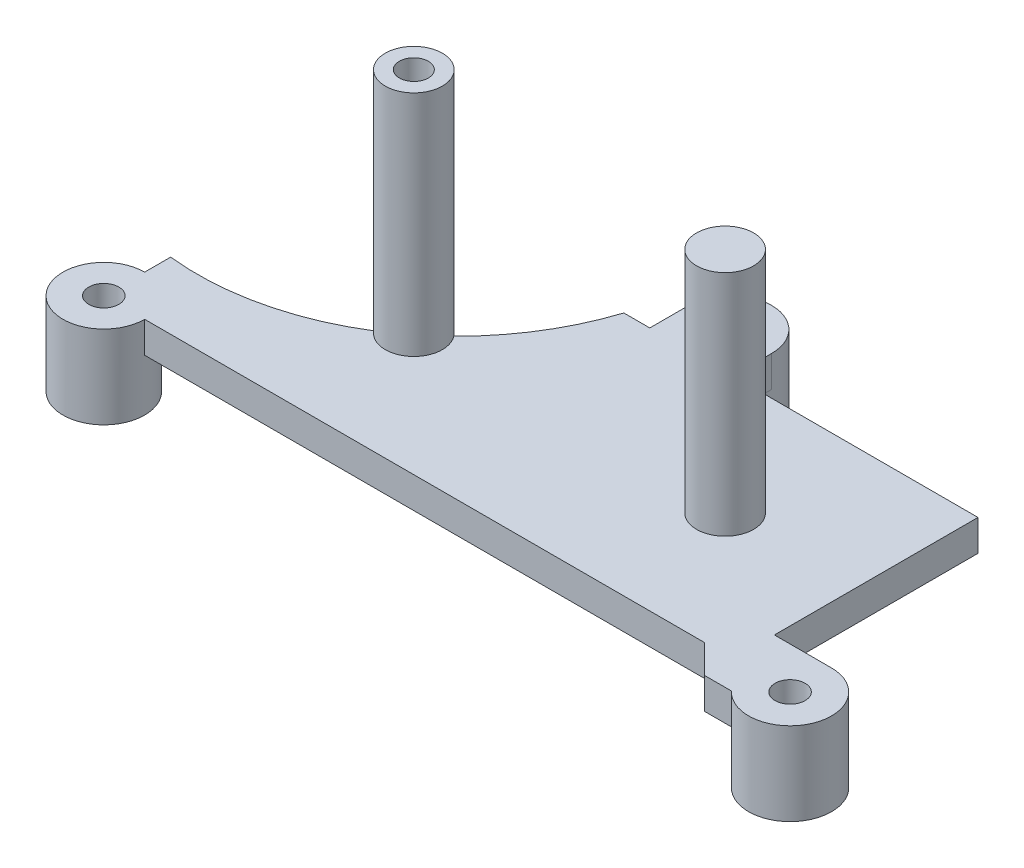
ISO-10303-21;
HEADER;
FILE_DESCRIPTION(('STEP AP214'),'2;1');
FILE_NAME('part.step','',(''),(''),'','','');
FILE_SCHEMA(('AUTOMOTIVE_DESIGN { 1 0 10303 214 1 1 1 1 }'));
ENDSEC;
DATA;
#1=APPLICATION_CONTEXT('core data for automotive mechanical design processes');
#2=APPLICATION_PROTOCOL_DEFINITION('international standard','automotive_design',2000,#1);
#3=PRODUCT_CONTEXT('',#1,'mechanical');
#4=PRODUCT('Part','Part','',(#3));
#5=PRODUCT_RELATED_PRODUCT_CATEGORY('part','',(#4));
#6=PRODUCT_DEFINITION_FORMATION('','',#4);
#7=PRODUCT_DEFINITION_CONTEXT('part definition',#1,'design');
#8=PRODUCT_DEFINITION('design','',#6,#7);
#9=PRODUCT_DEFINITION_SHAPE('','',#8);
#10=(LENGTH_UNIT() NAMED_UNIT(*) SI_UNIT(.MILLI.,.METRE.));
#11=(NAMED_UNIT(*) PLANE_ANGLE_UNIT() SI_UNIT($,.RADIAN.));
#12=(NAMED_UNIT(*) SI_UNIT($,.STERADIAN.) SOLID_ANGLE_UNIT());
#13=UNCERTAINTY_MEASURE_WITH_UNIT(LENGTH_MEASURE(1.E-05),#10,'distance_accuracy_value','');
#14=(GEOMETRIC_REPRESENTATION_CONTEXT(3) GLOBAL_UNCERTAINTY_ASSIGNED_CONTEXT((#13)) GLOBAL_UNIT_ASSIGNED_CONTEXT((#10,
#11,#12)) REPRESENTATION_CONTEXT('',''));
#15=CARTESIAN_POINT('',(0.,0.,0.));
#16=DIRECTION('',(0.,0.,1.));
#17=DIRECTION('',(1.,0.,0.));
#18=AXIS2_PLACEMENT_3D('',#15,#16,#17);
#19=CARTESIAN_POINT('',(0.,0.,0.));
#20=DIRECTION('',(0.,1.,0.));
#21=DIRECTION('',(0.,0.,1.));
#22=AXIS2_PLACEMENT_3D('',#19,#20,#21);
#23=PLANE('',#22);
#24=CARTESIAN_POINT('',(3.40995,0.,-34.7599));
#25=DIRECTION('',(0.,-1.,0.));
#26=DIRECTION('',(0.,0.,-1.));
#27=AXIS2_PLACEMENT_3D('',#24,#25,#26);
#28=CIRCLE('',#27,5.08);
#29=CARTESIAN_POINT('',(8.48995,0.,-34.7599));
#30=VERTEX_POINT('',#29);
#31=CARTESIAN_POINT('',(-1.67005,0.,-34.7599));
#32=VERTEX_POINT('',#31);
#33=EDGE_CURVE('E171',#30,#32,#28,.T.);
#34=ORIENTED_EDGE('',*,*,#33,.F.);
#35=DIRECTION('',(0.,0.,-1.));
#36=VECTOR('',#35,1.);
#37=CARTESIAN_POINT('',(8.48995000000001,0.,0.));
#38=LINE('',#37,#36);
#39=CARTESIAN_POINT('',(8.48995,0.,-29.9974));
#40=VERTEX_POINT('',#39);
#41=EDGE_CURVE('E153',#40,#30,#38,.T.);
#42=ORIENTED_EDGE('',*,*,#41,.F.);
#43=DIRECTION('',(1.,0.,0.));
#44=VECTOR('',#43,1.);
#45=CARTESIAN_POINT('',(0.,0.,-29.9974));
#46=LINE('',#45,#44);
#47=CARTESIAN_POINT('',(38.50005,0.,-29.9974));
#48=VERTEX_POINT('',#47);
#49=EDGE_CURVE('E165',#40,#48,#46,.T.);
#50=ORIENTED_EDGE('',*,*,#49,.T.);
#51=DIRECTION('',(0.,0.,1.));
#52=VECTOR('',#51,1.);
#53=CARTESIAN_POINT('',(38.50005,0.,0.));
#54=LINE('',#53,#52);
#55=CARTESIAN_POINT('',(38.50005,0.,-5.08));
#56=VERTEX_POINT('',#55);
#57=EDGE_CURVE('E318',#48,#56,#54,.T.);
#58=ORIENTED_EDGE('',*,*,#57,.T.);
#59=DIRECTION('',(1.,0.,0.));
#60=VECTOR('',#59,1.);
#61=CARTESIAN_POINT('',(0.,0.,-5.08));
#62=LINE('',#61,#60);
#63=CARTESIAN_POINT('',(45.49775,0.,-5.08));
#64=VERTEX_POINT('',#63);
#65=EDGE_CURVE('E314',#56,#64,#62,.T.);
#66=ORIENTED_EDGE('',*,*,#65,.T.);
#67=CARTESIAN_POINT('',(45.49775,0.,0.));
#68=DIRECTION('',(0.,-1.,0.));
#69=DIRECTION('',(0.,0.,-1.));
#70=AXIS2_PLACEMENT_3D('',#67,#68,#69);
#71=CIRCLE('',#70,5.08);
#72=CARTESIAN_POINT('',(41.8028027406504,0.,3.48622500000001));
#73=VERTEX_POINT('',#72);
#74=EDGE_CURVE('E195',#73,#64,#71,.T.);
#75=ORIENTED_EDGE('',*,*,#74,.F.);
#76=DIRECTION('',(1.,0.,0.));
#77=VECTOR('',#76,1.);
#78=CARTESIAN_POINT('',(0.,0.,3.48622500000001));
#79=LINE('',#78,#77);
#80=CARTESIAN_POINT('',(38.50005,0.,3.48622500000001));
#81=VERTEX_POINT('',#80);
#82=EDGE_CURVE('E310',#81,#73,#79,.T.);
#83=ORIENTED_EDGE('',*,*,#82,.F.);
#84=DIRECTION('',(-0.70710678118655,0.,-0.707106781186545));
#85=VECTOR('',#84,1.);
#86=CARTESIAN_POINT('',(17.5069124999998,0.,-17.5069125));
#87=LINE('',#86,#85);
#88=CARTESIAN_POINT('',(35.013825,0.,0.));
#89=VERTEX_POINT('',#88);
#90=EDGE_CURVE('E306',#81,#89,#87,.T.);
#91=ORIENTED_EDGE('',*,*,#90,.T.);
#92=DIRECTION('',(1.,0.,0.));
#93=VECTOR('',#92,1.);
#94=CARTESIAN_POINT('',(0.,0.,0.));
#95=LINE('',#94,#93);
#96=CARTESIAN_POINT('',(-33.498075,0.,0.));
#97=VERTEX_POINT('',#96);
#98=EDGE_CURVE('E246',#97,#89,#95,.T.);
#99=ORIENTED_EDGE('',*,*,#98,.F.);
#100=CARTESIAN_POINT('',(-38.50005,0.,0.));
#101=DIRECTION('',(0.,-1.,0.));
#102=DIRECTION('',(0.,0.,-1.));
#103=AXIS2_PLACEMENT_3D('',#100,#101,#102);
#104=CIRCLE('',#103,5.00197499999999);
#105=CARTESIAN_POINT('',(-38.50005,0.,-5.00197499999999));
#106=VERTEX_POINT('',#105);
#107=EDGE_CURVE('E206',#106,#97,#104,.T.);
#108=ORIENTED_EDGE('',*,*,#107,.F.);
#109=DIRECTION('',(0.,0.,1.));
#110=VECTOR('',#109,1.);
#111=CARTESIAN_POINT('',(-38.50005,0.,0.));
#112=LINE('',#111,#110);
#113=CARTESIAN_POINT('',(-38.50005,0.,-8.17697499999999));
#114=VERTEX_POINT('',#113);
#115=EDGE_CURVE('E252',#114,#106,#112,.T.);
#116=ORIENTED_EDGE('',*,*,#115,.F.);
#117=CARTESIAN_POINT('',(-35.0631940157804,0.,-39.7404114565035));
#118=DIRECTION('',(0.,1.,0.));
#119=DIRECTION('',(0.,0.,1.));
#120=AXIS2_PLACEMENT_3D('',#117,#118,#119);
#121=CIRCLE('',#120,31.75);
#122=CARTESIAN_POINT('',(-18.2650620731216,0.,-12.7981535103508));
#123=VERTEX_POINT('',#122);
#124=EDGE_CURVE('E237',#114,#123,#121,.T.);
#125=ORIENTED_EDGE('',*,*,#124,.T.);
#126=CARTESIAN_POINT('',(-15.55115,0.,-14.9963886));
#127=DIRECTION('',(0.,1.,0.));
#128=DIRECTION('',(0.,0.,1.));
#129=AXIS2_PLACEMENT_3D('',#126,#127,#128);
#130=CIRCLE('',#129,3.4925);
#131=CARTESIAN_POINT('',(-12.7806774825708,0.,-17.12289707169));
#132=VERTEX_POINT('',#131);
#133=EDGE_CURVE('E56',#132,#123,#130,.T.);
#134=ORIENTED_EDGE('',*,*,#133,.F.);
#135=CARTESIAN_POINT('',(-4.84505,0.,-29.9974));
#136=VERTEX_POINT('',#135);
#137=EDGE_CURVE('E61',#132,#136,#121,.T.);
#138=ORIENTED_EDGE('',*,*,#137,.T.);
#139=CARTESIAN_POINT('',(-1.67005,0.,-29.9974));
#140=VERTEX_POINT('',#139);
#141=EDGE_CURVE('E323',#136,#140,#46,.T.);
#142=ORIENTED_EDGE('',*,*,#141,.T.);
#143=DIRECTION('',(0.,0.,-1.));
#144=VECTOR('',#143,1.);
#145=CARTESIAN_POINT('',(-1.67005,0.,0.));
#146=LINE('',#145,#144);
#147=EDGE_CURVE('E164',#140,#32,#146,.T.);
#148=ORIENTED_EDGE('',*,*,#147,.T.);
#149=EDGE_LOOP('',(#34,#42,#50,#58,#66,#75,#83,#91,#99,#108,#116,#125,#134,#138,#142,#148));
#150=FACE_BOUND('',#149,.T.);
#151=ADVANCED_FACE('F40',(#150),#23,.F.);
#152=CARTESIAN_POINT('',(-35.0631940157804,3.81,-39.7404114565035));
#153=DIRECTION('',(0.,-1.,0.));
#154=DIRECTION('',(0.,0.,-1.));
#155=AXIS2_PLACEMENT_3D('',#152,#153,#154);
#156=CYLINDRICAL_SURFACE('',#155,31.75);
#157=CARTESIAN_POINT('',(-35.0631940157804,3.81,-39.7404114565035));
#158=DIRECTION('',(0.,1.,0.));
#159=DIRECTION('',(0.,0.,1.));
#160=AXIS2_PLACEMENT_3D('',#157,#158,#159);
#161=CIRCLE('',#160,31.75);
#162=CARTESIAN_POINT('',(-38.50005,3.81,-8.17697499999999));
#163=VERTEX_POINT('',#162);
#164=CARTESIAN_POINT('',(-18.2650620731215,3.81,-12.7981535103508));
#165=VERTEX_POINT('',#164);
#166=EDGE_CURVE('E231',#163,#165,#161,.T.);
#167=ORIENTED_EDGE('',*,*,#166,.T.);
#168=DIRECTION('',(0.,-1.,0.));
#169=VECTOR('',#168,1.);
#170=CARTESIAN_POINT('',(-18.2650620731216,15.875,-12.7981535103508));
#171=LINE('',#170,#169);
#172=EDGE_CURVE('E11',#165,#123,#171,.T.);
#173=ORIENTED_EDGE('',*,*,#172,.T.);
#174=ORIENTED_EDGE('',*,*,#124,.F.);
#175=DIRECTION('',(0.,-1.,0.));
#176=VECTOR('',#175,1.);
#177=CARTESIAN_POINT('',(-38.50005,3.81,-8.17697499999999));
#178=LINE('',#177,#176);
#179=EDGE_CURVE('E242',#163,#114,#178,.T.);
#180=ORIENTED_EDGE('',*,*,#179,.F.);
#181=EDGE_LOOP('',(#167,#173,#174,#180));
#182=FACE_BOUND('',#181,.T.);
#183=ADVANCED_FACE('F426',(#182),#156,.F.);
#184=ORIENTED_EDGE('',*,*,#137,.F.);
#185=DIRECTION('',(0.,-1.,0.));
#186=VECTOR('',#185,1.);
#187=CARTESIAN_POINT('',(-12.7806774825708,15.875,-17.12289707169));
#188=LINE('',#187,#186);
#189=CARTESIAN_POINT('',(-12.7806774825708,3.81,-17.12289707169));
#190=VERTEX_POINT('',#189);
#191=EDGE_CURVE('E49',#132,#190,#188,.F.);
#192=ORIENTED_EDGE('',*,*,#191,.T.);
#193=CARTESIAN_POINT('',(-4.84505,3.81,-29.9974));
#194=VERTEX_POINT('',#193);
#195=EDGE_CURVE('E236',#190,#194,#161,.T.);
#196=ORIENTED_EDGE('',*,*,#195,.T.);
#197=DIRECTION('',(0.,-1.,0.));
#198=VECTOR('',#197,1.);
#199=CARTESIAN_POINT('',(-4.84505,3.81,-29.9974));
#200=LINE('',#199,#198);
#201=EDGE_CURVE('E235',#194,#136,#200,.T.);
#202=ORIENTED_EDGE('',*,*,#201,.T.);
#203=EDGE_LOOP('',(#184,#192,#196,#202));
#204=FACE_BOUND('',#203,.T.);
#205=ADVANCED_FACE('F368',(#204),#156,.F.);
#206=CARTESIAN_POINT('',(0.,3.81,-29.9974));
#207=DIRECTION('',(0.,0.,-1.));
#208=DIRECTION('',(-1.,0.,0.));
#209=AXIS2_PLACEMENT_3D('',#206,#207,#208);
#210=PLANE('',#209);
#211=ORIENTED_EDGE('',*,*,#141,.F.);
#212=ORIENTED_EDGE('',*,*,#201,.F.);
#213=DIRECTION('',(1.,0.,0.));
#214=VECTOR('',#213,1.);
#215=CARTESIAN_POINT('',(0.,3.81,-29.9974));
#216=LINE('',#215,#214);
#217=CARTESIAN_POINT('',(-1.67005,3.81,-29.9974));
#218=VERTEX_POINT('',#217);
#219=EDGE_CURVE('E282',#194,#218,#216,.T.);
#220=ORIENTED_EDGE('',*,*,#219,.T.);
#221=DIRECTION('',(0.,-1.,0.));
#222=VECTOR('',#221,1.);
#223=CARTESIAN_POINT('',(-1.67005,3.81,-29.9974));
#224=LINE('',#223,#222);
#225=EDGE_CURVE('E333',#218,#140,#224,.T.);
#226=ORIENTED_EDGE('',*,*,#225,.T.);
#227=EDGE_LOOP('',(#211,#212,#220,#226));
#228=FACE_BOUND('',#227,.T.);
#229=ADVANCED_FACE('F383',(#228),#210,.T.);
#230=CARTESIAN_POINT('',(-38.50005,3.81,0.));
#231=DIRECTION('',(1.,0.,0.));
#232=DIRECTION('',(0.,0.,-1.));
#233=AXIS2_PLACEMENT_3D('',#230,#231,#232);
#234=PLANE('',#233);
#235=ORIENTED_EDGE('',*,*,#179,.T.);
#236=ORIENTED_EDGE('',*,*,#115,.T.);
#237=DIRECTION('',(0.,-1.,0.));
#238=VECTOR('',#237,1.);
#239=CARTESIAN_POINT('',(-38.50005,3.81,-5.00197499999999));
#240=LINE('',#239,#238);
#241=CARTESIAN_POINT('',(-38.50005,3.81,-5.00197499999999));
#242=VERTEX_POINT('',#241);
#243=EDGE_CURVE('E302',#242,#106,#240,.T.);
#244=ORIENTED_EDGE('',*,*,#243,.F.);
#245=DIRECTION('',(0.,0.,1.));
#246=VECTOR('',#245,1.);
#247=CARTESIAN_POINT('',(-38.50005,3.81,0.));
#248=LINE('',#247,#246);
#249=EDGE_CURVE('E291',#163,#242,#248,.T.);
#250=ORIENTED_EDGE('',*,*,#249,.F.);
#251=EDGE_LOOP('',(#235,#236,#244,#250));
#252=FACE_BOUND('',#251,.T.);
#253=ADVANCED_FACE('F424',(#252),#234,.F.);
#254=CARTESIAN_POINT('',(0.,3.81,0.));
#255=DIRECTION('',(0.,1.,0.));
#256=DIRECTION('',(0.,0.,1.));
#257=AXIS2_PLACEMENT_3D('',#254,#255,#256);
#258=PLANE('',#257);
#259=CARTESIAN_POINT('',(22.54885,3.81,-14.9963886));
#260=DIRECTION('',(0.,1.,0.));
#261=DIRECTION('',(0.,0.,1.));
#262=AXIS2_PLACEMENT_3D('',#259,#260,#261);
#263=CIRCLE('',#262,3.4925);
#264=CARTESIAN_POINT('',(22.54885,3.81,-11.5038886));
#265=VERTEX_POINT('',#264);
#266=EDGE_CURVE('E217',#265,#265,#263,.F.);
#267=ORIENTED_EDGE('',*,*,#266,.T.);
#268=EDGE_LOOP('',(#267));
#269=FACE_BOUND('',#268,.T.);
#270=CARTESIAN_POINT('',(45.49775,3.81,0.));
#271=DIRECTION('',(0.,1.,0.));
#272=DIRECTION('',(0.,0.,1.));
#273=AXIS2_PLACEMENT_3D('',#270,#271,#272);
#274=CIRCLE('',#273,1.8415);
#275=CARTESIAN_POINT('',(45.49775,3.81,1.8415));
#276=VERTEX_POINT('',#275);
#277=EDGE_CURVE('E247',#276,#276,#274,.T.);
#278=ORIENTED_EDGE('',*,*,#277,.F.);
#279=EDGE_LOOP('',(#278));
#280=FACE_BOUND('',#279,.T.);
#281=CARTESIAN_POINT('',(-38.50005,3.81,0.));
#282=DIRECTION('',(0.,1.,0.));
#283=DIRECTION('',(0.,0.,1.));
#284=AXIS2_PLACEMENT_3D('',#281,#282,#283);
#285=CIRCLE('',#284,1.8415);
#286=CARTESIAN_POINT('',(-38.50005,3.81,1.8415));
#287=VERTEX_POINT('',#286);
#288=EDGE_CURVE('E294',#287,#287,#285,.T.);
#289=ORIENTED_EDGE('',*,*,#288,.F.);
#290=EDGE_LOOP('',(#289));
#291=FACE_BOUND('',#290,.T.);
#292=CARTESIAN_POINT('',(3.40995,3.81,-34.7599));
#293=DIRECTION('',(0.,1.,0.));
#294=DIRECTION('',(0.,0.,1.));
#295=AXIS2_PLACEMENT_3D('',#292,#293,#294);
#296=CIRCLE('',#295,1.8415);
#297=CARTESIAN_POINT('',(3.40995,3.81,-32.9184));
#298=VERTEX_POINT('',#297);
#299=EDGE_CURVE('E298',#298,#298,#296,.T.);
#300=ORIENTED_EDGE('',*,*,#299,.F.);
#301=EDGE_LOOP('',(#300));
#302=FACE_BOUND('',#301,.T.);
#303=ORIENTED_EDGE('',*,*,#195,.F.);
#304=CARTESIAN_POINT('',(-15.55115,3.81,-14.9963886));
#305=DIRECTION('',(0.,1.,0.));
#306=DIRECTION('',(0.,0.,1.));
#307=AXIS2_PLACEMENT_3D('',#304,#305,#306);
#308=CIRCLE('',#307,3.4925);
#309=EDGE_CURVE('E225',#190,#165,#308,.F.);
#310=ORIENTED_EDGE('',*,*,#309,.T.);
#311=ORIENTED_EDGE('',*,*,#166,.F.);
#312=ORIENTED_EDGE('',*,*,#249,.T.);
#313=CARTESIAN_POINT('',(-38.50005,3.81,0.));
#314=DIRECTION('',(0.,1.,0.));
#315=DIRECTION('',(0.,0.,1.));
#316=AXIS2_PLACEMENT_3D('',#313,#314,#315);
#317=CIRCLE('',#316,5.00197499999999);
#318=CARTESIAN_POINT('',(-33.498075,3.81,0.));
#319=VERTEX_POINT('',#318);
#320=EDGE_CURVE('E251',#242,#319,#317,.T.);
#321=ORIENTED_EDGE('',*,*,#320,.T.);
#322=DIRECTION('',(1.,0.,0.));
#323=VECTOR('',#322,1.);
#324=CARTESIAN_POINT('',(0.,3.81,0.));
#325=LINE('',#324,#323);
#326=CARTESIAN_POINT('',(35.013825,3.81,0.));
#327=VERTEX_POINT('',#326);
#328=EDGE_CURVE('E256',#319,#327,#325,.T.);
#329=ORIENTED_EDGE('',*,*,#328,.T.);
#330=DIRECTION('',(-0.70710678118655,0.,-0.707106781186545));
#331=VECTOR('',#330,1.);
#332=CARTESIAN_POINT('',(17.5069124999998,3.81,-17.5069125));
#333=LINE('',#332,#331);
#334=CARTESIAN_POINT('',(38.50005,3.81,3.48622500000001));
#335=VERTEX_POINT('',#334);
#336=EDGE_CURVE('E259',#335,#327,#333,.T.);
#337=ORIENTED_EDGE('',*,*,#336,.F.);
#338=DIRECTION('',(1.,0.,0.));
#339=VECTOR('',#338,1.);
#340=CARTESIAN_POINT('',(0.,3.81,3.48622500000001));
#341=LINE('',#340,#339);
#342=CARTESIAN_POINT('',(41.8028027406504,3.81,3.48622500000001));
#343=VERTEX_POINT('',#342);
#344=EDGE_CURVE('E263',#335,#343,#341,.T.);
#345=ORIENTED_EDGE('',*,*,#344,.T.);
#346=CARTESIAN_POINT('',(45.49775,3.81,0.));
#347=DIRECTION('',(0.,1.,0.));
#348=DIRECTION('',(0.,0.,1.));
#349=AXIS2_PLACEMENT_3D('',#346,#347,#348);
#350=CIRCLE('',#349,5.08);
#351=CARTESIAN_POINT('',(45.49775,3.81,-5.08));
#352=VERTEX_POINT('',#351);
#353=EDGE_CURVE('E266',#343,#352,#350,.T.);
#354=ORIENTED_EDGE('',*,*,#353,.T.);
#355=DIRECTION('',(1.,0.,0.));
#356=VECTOR('',#355,1.);
#357=CARTESIAN_POINT('',(0.,3.81,-5.08));
#358=LINE('',#357,#356);
#359=CARTESIAN_POINT('',(38.50005,3.81,-5.08));
#360=VERTEX_POINT('',#359);
#361=EDGE_CURVE('E269',#360,#352,#358,.T.);
#362=ORIENTED_EDGE('',*,*,#361,.F.);
#363=DIRECTION('',(0.,0.,1.));
#364=VECTOR('',#363,1.);
#365=CARTESIAN_POINT('',(38.50005,3.81,0.));
#366=LINE('',#365,#364);
#367=CARTESIAN_POINT('',(38.50005,3.81,-29.9974));
#368=VERTEX_POINT('',#367);
#369=EDGE_CURVE('E273',#368,#360,#366,.T.);
#370=ORIENTED_EDGE('',*,*,#369,.F.);
#371=CARTESIAN_POINT('',(8.48995,3.81,-29.9974));
#372=VERTEX_POINT('',#371);
#373=EDGE_CURVE('E277',#372,#368,#216,.T.);
#374=ORIENTED_EDGE('',*,*,#373,.F.);
#375=DIRECTION('',(0.,0.,-1.));
#376=VECTOR('',#375,1.);
#377=CARTESIAN_POINT('',(8.48995000000001,3.81,0.));
#378=LINE('',#377,#376);
#379=CARTESIAN_POINT('',(8.48995,3.81,-34.7599));
#380=VERTEX_POINT('',#379);
#381=EDGE_CURVE('E281',#372,#380,#378,.T.);
#382=ORIENTED_EDGE('',*,*,#381,.T.);
#383=CARTESIAN_POINT('',(3.40995,3.81,-34.7599));
#384=DIRECTION('',(0.,1.,0.));
#385=DIRECTION('',(0.,0.,1.));
#386=AXIS2_PLACEMENT_3D('',#383,#384,#385);
#387=CIRCLE('',#386,5.08);
#388=CARTESIAN_POINT('',(-1.67005,3.81,-34.7599));
#389=VERTEX_POINT('',#388);
#390=EDGE_CURVE('E173',#389,#380,#387,.F.);
#391=ORIENTED_EDGE('',*,*,#390,.F.);
#392=DIRECTION('',(0.,0.,-1.));
#393=VECTOR('',#392,1.);
#394=CARTESIAN_POINT('',(-1.67005,3.81,0.));
#395=LINE('',#394,#393);
#396=EDGE_CURVE('E287',#218,#389,#395,.T.);
#397=ORIENTED_EDGE('',*,*,#396,.F.);
#398=ORIENTED_EDGE('',*,*,#219,.F.);
#399=EDGE_LOOP('',(#303,#310,#311,#312,#321,#329,#337,#345,#354,#362,#370,#374,#382,#391,#397,#398));
#400=FACE_BOUND('',#399,.T.);
#401=ADVANCED_FACE('F373',(#269,#280,#291,#302,#400),#258,.T.);
#402=CARTESIAN_POINT('',(-38.50005,3.81,0.));
#403=DIRECTION('',(0.,-1.,0.));
#404=DIRECTION('',(0.,0.,-1.));
#405=AXIS2_PLACEMENT_3D('',#402,#403,#404);
#406=CYLINDRICAL_SURFACE('',#405,5.00197499999999);
#407=ORIENTED_EDGE('',*,*,#243,.T.);
#408=ORIENTED_EDGE('',*,*,#107,.T.);
#409=DIRECTION('',(0.,-1.,0.));
#410=VECTOR('',#409,1.);
#411=CARTESIAN_POINT('',(-33.498075,3.81,0.));
#412=LINE('',#411,#410);
#413=EDGE_CURVE('E361',#319,#97,#412,.T.);
#414=ORIENTED_EDGE('',*,*,#413,.F.);
#415=ORIENTED_EDGE('',*,*,#320,.F.);
#416=EDGE_LOOP('',(#407,#408,#414,#415));
#417=FACE_BOUND('',#416,.T.);
#418=CARTESIAN_POINT('',(-38.50005,-6.35,0.));
#419=DIRECTION('',(0.,-1.,0.));
#420=DIRECTION('',(0.,0.,-1.));
#421=AXIS2_PLACEMENT_3D('',#418,#419,#420);
#422=CIRCLE('',#421,5.00197499999999);
#423=CARTESIAN_POINT('',(-38.50005,-6.35,-5.00197499999999));
#424=VERTEX_POINT('',#423);
#425=EDGE_CURVE('E207',#424,#424,#422,.T.);
#426=ORIENTED_EDGE('',*,*,#425,.F.);
#427=EDGE_LOOP('',(#426));
#428=FACE_BOUND('',#427,.T.);
#429=ADVANCED_FACE('F419',(#417,#428),#406,.T.);
#430=CARTESIAN_POINT('',(0.,3.81,0.));
#431=DIRECTION('',(0.,0.,-1.));
#432=DIRECTION('',(-1.,0.,0.));
#433=AXIS2_PLACEMENT_3D('',#430,#431,#432);
#434=PLANE('',#433);
#435=ORIENTED_EDGE('',*,*,#98,.T.);
#436=DIRECTION('',(0.,-1.,0.));
#437=VECTOR('',#436,1.);
#438=CARTESIAN_POINT('',(35.013825,3.81,0.));
#439=LINE('',#438,#437);
#440=EDGE_CURVE('E358',#327,#89,#439,.T.);
#441=ORIENTED_EDGE('',*,*,#440,.F.);
#442=ORIENTED_EDGE('',*,*,#328,.F.);
#443=ORIENTED_EDGE('',*,*,#413,.T.);
#444=EDGE_LOOP('',(#435,#441,#442,#443));
#445=FACE_BOUND('',#444,.T.);
#446=ADVANCED_FACE('F416',(#445),#434,.F.);
#447=CARTESIAN_POINT('',(17.5069124999998,3.81,-17.5069125));
#448=DIRECTION('',(-0.707106781186545,0.,0.70710678118655));
#449=DIRECTION('',(0.70710678118655,0.,0.707106781186545));
#450=AXIS2_PLACEMENT_3D('',#447,#448,#449);
#451=PLANE('',#450);
#452=ORIENTED_EDGE('',*,*,#90,.F.);
#453=DIRECTION('',(0.,-1.,0.));
#454=VECTOR('',#453,1.);
#455=CARTESIAN_POINT('',(38.50005,3.81,3.48622500000001));
#456=LINE('',#455,#454);
#457=EDGE_CURVE('E355',#335,#81,#456,.T.);
#458=ORIENTED_EDGE('',*,*,#457,.F.);
#459=ORIENTED_EDGE('',*,*,#336,.T.);
#460=ORIENTED_EDGE('',*,*,#440,.T.);
#461=EDGE_LOOP('',(#452,#458,#459,#460));
#462=FACE_BOUND('',#461,.T.);
#463=ADVANCED_FACE('F410',(#462),#451,.T.);
#464=CARTESIAN_POINT('',(0.,3.81,3.48622500000001));
#465=DIRECTION('',(0.,0.,-1.));
#466=DIRECTION('',(-1.,0.,0.));
#467=AXIS2_PLACEMENT_3D('',#464,#465,#466);
#468=PLANE('',#467);
#469=ORIENTED_EDGE('',*,*,#82,.T.);
#470=DIRECTION('',(0.,-1.,0.));
#471=VECTOR('',#470,1.);
#472=CARTESIAN_POINT('',(41.8028027406504,3.81,3.48622500000001));
#473=LINE('',#472,#471);
#474=EDGE_CURVE('E351',#343,#73,#473,.T.);
#475=ORIENTED_EDGE('',*,*,#474,.F.);
#476=ORIENTED_EDGE('',*,*,#344,.F.);
#477=ORIENTED_EDGE('',*,*,#457,.T.);
#478=EDGE_LOOP('',(#469,#475,#476,#477));
#479=FACE_BOUND('',#478,.T.);
#480=ADVANCED_FACE('F406',(#479),#468,.F.);
#481=CARTESIAN_POINT('',(45.49775,3.81,0.));
#482=DIRECTION('',(0.,-1.,0.));
#483=DIRECTION('',(0.,0.,-1.));
#484=AXIS2_PLACEMENT_3D('',#481,#482,#483);
#485=CYLINDRICAL_SURFACE('',#484,5.08);
#486=ORIENTED_EDGE('',*,*,#474,.T.);
#487=ORIENTED_EDGE('',*,*,#74,.T.);
#488=DIRECTION('',(0.,-1.,0.));
#489=VECTOR('',#488,1.);
#490=CARTESIAN_POINT('',(45.49775,3.81,-5.08));
#491=LINE('',#490,#489);
#492=EDGE_CURVE('E347',#352,#64,#491,.T.);
#493=ORIENTED_EDGE('',*,*,#492,.F.);
#494=ORIENTED_EDGE('',*,*,#353,.F.);
#495=EDGE_LOOP('',(#486,#487,#493,#494));
#496=FACE_BOUND('',#495,.T.);
#497=CARTESIAN_POINT('',(45.49775,-6.35,0.));
#498=DIRECTION('',(0.,-1.,0.));
#499=DIRECTION('',(0.,0.,-1.));
#500=AXIS2_PLACEMENT_3D('',#497,#498,#499);
#501=CIRCLE('',#500,5.08);
#502=CARTESIAN_POINT('',(45.49775,-6.35,-5.08));
#503=VERTEX_POINT('',#502);
#504=EDGE_CURVE('E196',#503,#503,#501,.T.);
#505=ORIENTED_EDGE('',*,*,#504,.F.);
#506=EDGE_LOOP('',(#505));
#507=FACE_BOUND('',#506,.T.);
#508=ADVANCED_FACE('F400',(#496,#507),#485,.T.);
#509=CARTESIAN_POINT('',(0.,3.81,-5.08));
#510=DIRECTION('',(0.,0.,-1.));
#511=DIRECTION('',(-1.,0.,0.));
#512=AXIS2_PLACEMENT_3D('',#509,#510,#511);
#513=PLANE('',#512);
#514=ORIENTED_EDGE('',*,*,#65,.F.);
#515=DIRECTION('',(0.,-1.,0.));
#516=VECTOR('',#515,1.);
#517=CARTESIAN_POINT('',(38.50005,3.81,-5.08));
#518=LINE('',#517,#516);
#519=EDGE_CURVE('E344',#360,#56,#518,.T.);
#520=ORIENTED_EDGE('',*,*,#519,.F.);
#521=ORIENTED_EDGE('',*,*,#361,.T.);
#522=ORIENTED_EDGE('',*,*,#492,.T.);
#523=EDGE_LOOP('',(#514,#520,#521,#522));
#524=FACE_BOUND('',#523,.T.);
#525=ADVANCED_FACE('F396',(#524),#513,.T.);
#526=CARTESIAN_POINT('',(38.50005,3.81,0.));
#527=DIRECTION('',(1.,0.,0.));
#528=DIRECTION('',(0.,0.,-1.));
#529=AXIS2_PLACEMENT_3D('',#526,#527,#528);
#530=PLANE('',#529);
#531=ORIENTED_EDGE('',*,*,#57,.F.);
#532=DIRECTION('',(0.,-1.,0.));
#533=VECTOR('',#532,1.);
#534=CARTESIAN_POINT('',(38.50005,3.81,-29.9974));
#535=LINE('',#534,#533);
#536=EDGE_CURVE('E341',#368,#48,#535,.T.);
#537=ORIENTED_EDGE('',*,*,#536,.F.);
#538=ORIENTED_EDGE('',*,*,#369,.T.);
#539=ORIENTED_EDGE('',*,*,#519,.T.);
#540=EDGE_LOOP('',(#531,#537,#538,#539));
#541=FACE_BOUND('',#540,.T.);
#542=ADVANCED_FACE('F394',(#541),#530,.T.);
#543=ORIENTED_EDGE('',*,*,#49,.F.);
#544=DIRECTION('',(0.,-1.,0.));
#545=VECTOR('',#544,1.);
#546=CARTESIAN_POINT('',(8.48995,3.81,-29.9974));
#547=LINE('',#546,#545);
#548=EDGE_CURVE('E159',#372,#40,#547,.T.);
#549=ORIENTED_EDGE('',*,*,#548,.F.);
#550=ORIENTED_EDGE('',*,*,#373,.T.);
#551=ORIENTED_EDGE('',*,*,#536,.T.);
#552=EDGE_LOOP('',(#543,#549,#550,#551));
#553=FACE_BOUND('',#552,.T.);
#554=ADVANCED_FACE('F390',(#553),#210,.T.);
#555=CARTESIAN_POINT('',(8.48995000000001,3.81,0.));
#556=DIRECTION('',(-1.,0.,0.));
#557=DIRECTION('',(0.,0.,1.));
#558=AXIS2_PLACEMENT_3D('',#555,#556,#557);
#559=PLANE('',#558);
#560=ORIENTED_EDGE('',*,*,#41,.T.);
#561=DIRECTION('',(0.,-1.,0.));
#562=VECTOR('',#561,1.);
#563=CARTESIAN_POINT('',(8.48995,3.81,-34.7599));
#564=LINE('',#563,#562);
#565=EDGE_CURVE('E157',#380,#30,#564,.T.);
#566=ORIENTED_EDGE('',*,*,#565,.F.);
#567=ORIENTED_EDGE('',*,*,#381,.F.);
#568=ORIENTED_EDGE('',*,*,#548,.T.);
#569=EDGE_LOOP('',(#560,#566,#567,#568));
#570=FACE_BOUND('',#569,.T.);
#571=ADVANCED_FACE('F155',(#570),#559,.F.);
#572=CARTESIAN_POINT('',(3.40995,3.81,-34.7599));
#573=DIRECTION('',(0.,-1.,0.));
#574=DIRECTION('',(0.,0.,-1.));
#575=AXIS2_PLACEMENT_3D('',#572,#573,#574);
#576=CYLINDRICAL_SURFACE('',#575,5.08);
#577=ORIENTED_EDGE('',*,*,#565,.T.);
#578=ORIENTED_EDGE('',*,*,#33,.T.);
#579=DIRECTION('',(0.,-1.,0.));
#580=VECTOR('',#579,1.);
#581=CARTESIAN_POINT('',(-1.67005,3.81,-34.7599));
#582=LINE('',#581,#580);
#583=EDGE_CURVE('E175',#389,#32,#582,.T.);
#584=ORIENTED_EDGE('',*,*,#583,.F.);
#585=ORIENTED_EDGE('',*,*,#390,.T.);
#586=EDGE_LOOP('',(#577,#578,#584,#585));
#587=FACE_BOUND('',#586,.T.);
#588=CARTESIAN_POINT('',(3.40995,-6.35,-34.7599));
#589=DIRECTION('',(0.,-1.,0.));
#590=DIRECTION('',(0.,0.,-1.));
#591=AXIS2_PLACEMENT_3D('',#588,#589,#590);
#592=CIRCLE('',#591,5.08);
#593=CARTESIAN_POINT('',(3.40995,-6.35,-39.8399));
#594=VERTEX_POINT('',#593);
#595=EDGE_CURVE('E180',#594,#594,#592,.T.);
#596=ORIENTED_EDGE('',*,*,#595,.F.);
#597=EDGE_LOOP('',(#596));
#598=FACE_BOUND('',#597,.T.);
#599=ADVANCED_FACE('F169',(#587,#598),#576,.T.);
#600=CARTESIAN_POINT('',(-1.67005,3.81,0.));
#601=DIRECTION('',(-1.,0.,0.));
#602=DIRECTION('',(0.,0.,1.));
#603=AXIS2_PLACEMENT_3D('',#600,#601,#602);
#604=PLANE('',#603);
#605=ORIENTED_EDGE('',*,*,#147,.F.);
#606=ORIENTED_EDGE('',*,*,#225,.F.);
#607=ORIENTED_EDGE('',*,*,#396,.T.);
#608=ORIENTED_EDGE('',*,*,#583,.T.);
#609=EDGE_LOOP('',(#605,#606,#607,#608));
#610=FACE_BOUND('',#609,.T.);
#611=ADVANCED_FACE('F385',(#610),#604,.T.);
#612=CARTESIAN_POINT('',(-38.50005,3.81,0.));
#613=DIRECTION('',(0.,-1.,0.));
#614=DIRECTION('',(0.,0.,-1.));
#615=AXIS2_PLACEMENT_3D('',#612,#613,#614);
#616=CYLINDRICAL_SURFACE('',#615,1.8415);
#617=ORIENTED_EDGE('',*,*,#288,.T.);
#618=EDGE_LOOP('',(#617));
#619=FACE_BOUND('',#618,.T.);
#620=CARTESIAN_POINT('',(-38.50005,-6.35,0.));
#621=DIRECTION('',(0.,-1.,0.));
#622=DIRECTION('',(0.,0.,-1.));
#623=AXIS2_PLACEMENT_3D('',#620,#621,#622);
#624=CIRCLE('',#623,1.8415);
#625=CARTESIAN_POINT('',(-38.50005,-6.35,-1.8415));
#626=VERTEX_POINT('',#625);
#627=EDGE_CURVE('E200',#626,#626,#624,.T.);
#628=ORIENTED_EDGE('',*,*,#627,.T.);
#629=EDGE_LOOP('',(#628));
#630=FACE_BOUND('',#629,.T.);
#631=ADVANCED_FACE('F460',(#619,#630),#616,.F.);
#632=CARTESIAN_POINT('',(45.49775,3.81,0.));
#633=DIRECTION('',(0.,-1.,0.));
#634=DIRECTION('',(0.,0.,-1.));
#635=AXIS2_PLACEMENT_3D('',#632,#633,#634);
#636=CYLINDRICAL_SURFACE('',#635,1.8415);
#637=ORIENTED_EDGE('',*,*,#277,.T.);
#638=EDGE_LOOP('',(#637));
#639=FACE_BOUND('',#638,.T.);
#640=CARTESIAN_POINT('',(45.49775,-6.35,0.));
#641=DIRECTION('',(0.,-1.,0.));
#642=DIRECTION('',(0.,0.,-1.));
#643=AXIS2_PLACEMENT_3D('',#640,#641,#642);
#644=CIRCLE('',#643,1.8415);
#645=CARTESIAN_POINT('',(45.49775,-6.35,-1.8415));
#646=VERTEX_POINT('',#645);
#647=EDGE_CURVE('E186',#646,#646,#644,.T.);
#648=ORIENTED_EDGE('',*,*,#647,.T.);
#649=EDGE_LOOP('',(#648));
#650=FACE_BOUND('',#649,.T.);
#651=ADVANCED_FACE('F42',(#639,#650),#636,.F.);
#652=CARTESIAN_POINT('',(3.40995,3.81,-34.7599));
#653=DIRECTION('',(0.,-1.,0.));
#654=DIRECTION('',(0.,0.,-1.));
#655=AXIS2_PLACEMENT_3D('',#652,#653,#654);
#656=CYLINDRICAL_SURFACE('',#655,1.8415);
#657=ORIENTED_EDGE('',*,*,#299,.T.);
#658=EDGE_LOOP('',(#657));
#659=FACE_BOUND('',#658,.T.);
#660=CARTESIAN_POINT('',(3.40995,-6.35,-34.7599));
#661=DIRECTION('',(0.,-1.,0.));
#662=DIRECTION('',(0.,0.,-1.));
#663=AXIS2_PLACEMENT_3D('',#660,#661,#662);
#664=CIRCLE('',#663,1.8415);
#665=CARTESIAN_POINT('',(3.40995,-6.35,-36.6014));
#666=VERTEX_POINT('',#665);
#667=EDGE_CURVE('E181',#666,#666,#664,.T.);
#668=ORIENTED_EDGE('',*,*,#667,.T.);
#669=EDGE_LOOP('',(#668));
#670=FACE_BOUND('',#669,.T.);
#671=ADVANCED_FACE('F431',(#659,#670),#656,.F.);
#672=CARTESIAN_POINT('',(-15.55115,31.75,-14.9963886));
#673=DIRECTION('',(0.,-1.,0.));
#674=DIRECTION('',(0.,0.,-1.));
#675=AXIS2_PLACEMENT_3D('',#672,#673,#674);
#676=CYLINDRICAL_SURFACE('',#675,3.4925);
#677=ORIENTED_EDGE('',*,*,#172,.F.);
#678=ORIENTED_EDGE('',*,*,#309,.F.);
#679=ORIENTED_EDGE('',*,*,#191,.F.);
#680=ORIENTED_EDGE('',*,*,#133,.T.);
#681=EDGE_LOOP('',(#677,#678,#679,#680));
#682=FACE_BOUND('',#681,.T.);
#683=CARTESIAN_POINT('',(-15.55115,31.75,-14.9963886));
#684=DIRECTION('',(0.,1.,0.));
#685=DIRECTION('',(0.,0.,1.));
#686=AXIS2_PLACEMENT_3D('',#683,#684,#685);
#687=CIRCLE('',#686,3.4925);
#688=CARTESIAN_POINT('',(-15.55115,31.75,-11.5038886));
#689=VERTEX_POINT('',#688);
#690=EDGE_CURVE('E221',#689,#689,#687,.T.);
#691=ORIENTED_EDGE('',*,*,#690,.F.);
#692=EDGE_LOOP('',(#691));
#693=FACE_BOUND('',#692,.T.);
#694=ADVANCED_FACE('F427',(#682,#693),#676,.T.);
#695=CARTESIAN_POINT('',(0.,31.75,0.));
#696=DIRECTION('',(0.,1.,0.));
#697=DIRECTION('',(0.,0.,1.));
#698=AXIS2_PLACEMENT_3D('',#695,#696,#697);
#699=PLANE('',#698);
#700=CARTESIAN_POINT('',(-15.55115,31.75,-14.9963886));
#701=DIRECTION('',(0.,1.,0.));
#702=DIRECTION('',(0.,0.,1.));
#703=AXIS2_PLACEMENT_3D('',#700,#701,#702);
#704=CIRCLE('',#703,1.778);
#705=CARTESIAN_POINT('',(-15.55115,31.75,-13.2183886));
#706=VERTEX_POINT('',#705);
#707=EDGE_CURVE('E562',#706,#706,#704,.T.);
#708=ORIENTED_EDGE('',*,*,#707,.F.);
#709=EDGE_LOOP('',(#708));
#710=FACE_BOUND('',#709,.T.);
#711=ORIENTED_EDGE('',*,*,#690,.T.);
#712=EDGE_LOOP('',(#711));
#713=FACE_BOUND('',#712,.T.);
#714=ADVANCED_FACE('F430',(#710,#713),#699,.T.);
#715=CARTESIAN_POINT('',(22.54885,31.75,-14.9963886));
#716=DIRECTION('',(0.,-1.,0.));
#717=DIRECTION('',(0.,0.,-1.));
#718=AXIS2_PLACEMENT_3D('',#715,#716,#717);
#719=CYLINDRICAL_SURFACE('',#718,3.4925);
#720=ORIENTED_EDGE('',*,*,#266,.F.);
#721=EDGE_LOOP('',(#720));
#722=FACE_BOUND('',#721,.T.);
#723=CARTESIAN_POINT('',(22.54885,31.75,-14.9963886));
#724=DIRECTION('',(0.,1.,0.));
#725=DIRECTION('',(0.,0.,1.));
#726=AXIS2_PLACEMENT_3D('',#723,#724,#725);
#727=CIRCLE('',#726,3.4925);
#728=CARTESIAN_POINT('',(22.54885,31.75,-11.5038886));
#729=VERTEX_POINT('',#728);
#730=EDGE_CURVE('E211',#729,#729,#727,.T.);
#731=ORIENTED_EDGE('',*,*,#730,.F.);
#732=EDGE_LOOP('',(#731));
#733=FACE_BOUND('',#732,.T.);
#734=ADVANCED_FACE('F436',(#722,#733),#719,.T.);
#735=CARTESIAN_POINT('',(22.54885,31.75,-14.9963886));
#736=DIRECTION('',(0.,1.,0.));
#737=DIRECTION('',(0.,0.,1.));
#738=AXIS2_PLACEMENT_3D('',#735,#736,#737);
#739=PLANE('',#738);
#740=ORIENTED_EDGE('',*,*,#730,.T.);
#741=EDGE_LOOP('',(#740));
#742=FACE_BOUND('',#741,.T.);
#743=ADVANCED_FACE('F444',(#742),#739,.T.);
#744=CARTESIAN_POINT('',(-38.50005,-6.35,0.));
#745=DIRECTION('',(0.,-1.,0.));
#746=DIRECTION('',(0.,0.,-1.));
#747=AXIS2_PLACEMENT_3D('',#744,#745,#746);
#748=PLANE('',#747);
#749=ORIENTED_EDGE('',*,*,#425,.T.);
#750=EDGE_LOOP('',(#749));
#751=FACE_BOUND('',#750,.T.);
#752=ORIENTED_EDGE('',*,*,#627,.F.);
#753=EDGE_LOOP('',(#752));
#754=FACE_BOUND('',#753,.T.);
#755=ADVANCED_FACE('F514',(#751,#754),#748,.T.);
#756=CARTESIAN_POINT('',(45.49775,-6.35,0.));
#757=DIRECTION('',(0.,-1.,0.));
#758=DIRECTION('',(0.,0.,-1.));
#759=AXIS2_PLACEMENT_3D('',#756,#757,#758);
#760=PLANE('',#759);
#761=ORIENTED_EDGE('',*,*,#504,.T.);
#762=EDGE_LOOP('',(#761));
#763=FACE_BOUND('',#762,.T.);
#764=ORIENTED_EDGE('',*,*,#647,.F.);
#765=EDGE_LOOP('',(#764));
#766=FACE_BOUND('',#765,.T.);
#767=ADVANCED_FACE('F505',(#763,#766),#760,.T.);
#768=CARTESIAN_POINT('',(3.40995,-6.35,-34.7599));
#769=DIRECTION('',(0.,-1.,0.));
#770=DIRECTION('',(0.,0.,-1.));
#771=AXIS2_PLACEMENT_3D('',#768,#769,#770);
#772=PLANE('',#771);
#773=ORIENTED_EDGE('',*,*,#595,.T.);
#774=EDGE_LOOP('',(#773));
#775=FACE_BOUND('',#774,.T.);
#776=ORIENTED_EDGE('',*,*,#667,.F.);
#777=EDGE_LOOP('',(#776));
#778=FACE_BOUND('',#777,.T.);
#779=ADVANCED_FACE('F502',(#775,#778),#772,.T.);
#780=CARTESIAN_POINT('',(-15.55115,26.67,-14.9963886));
#781=DIRECTION('',(0.,1.,0.));
#782=DIRECTION('',(0.,0.,1.));
#783=AXIS2_PLACEMENT_3D('',#780,#781,#782);
#784=CYLINDRICAL_SURFACE('',#783,1.778);
#785=CARTESIAN_POINT('',(-15.55115,26.67,-14.9963886));
#786=DIRECTION('',(0.,1.,0.));
#787=DIRECTION('',(0.,0.,1.));
#788=AXIS2_PLACEMENT_3D('',#785,#786,#787);
#789=CIRCLE('',#788,1.778);
#790=CARTESIAN_POINT('',(-15.55115,26.67,-13.2183886));
#791=VERTEX_POINT('',#790);
#792=EDGE_CURVE('E189',#791,#791,#789,.T.);
#793=ORIENTED_EDGE('',*,*,#792,.F.);
#794=EDGE_LOOP('',(#793));
#795=FACE_BOUND('',#794,.T.);
#796=ORIENTED_EDGE('',*,*,#707,.T.);
#797=EDGE_LOOP('',(#796));
#798=FACE_BOUND('',#797,.T.);
#799=ADVANCED_FACE('F504',(#795,#798),#784,.F.);
#800=CARTESIAN_POINT('',(-15.55115,26.67,-14.9963886));
#801=DIRECTION('',(0.,1.,0.));
#802=DIRECTION('',(0.,0.,1.));
#803=AXIS2_PLACEMENT_3D('',#800,#801,#802);
#804=PLANE('',#803);
#805=ORIENTED_EDGE('',*,*,#792,.T.);
#806=EDGE_LOOP('',(#805));
#807=FACE_BOUND('',#806,.T.);
#808=ADVANCED_FACE('F511',(#807),#804,.T.);
#809=CLOSED_SHELL('',(#151,#183,#205,#229,#253,#401,#429,#446,#463,#480,#508,#525,#542,#554,
#571,#599,#611,#631,#651,#671,#694,#714,#734,#743,#755,#767,#779,#799,#808));
#810=MANIFOLD_SOLID_BREP('B2',#809);
#811=ADVANCED_BREP_SHAPE_REPRESENTATION('',(#18,#810),#14);
#812=SHAPE_DEFINITION_REPRESENTATION(#9,#811);
ENDSEC;
END-ISO-10303-21;
